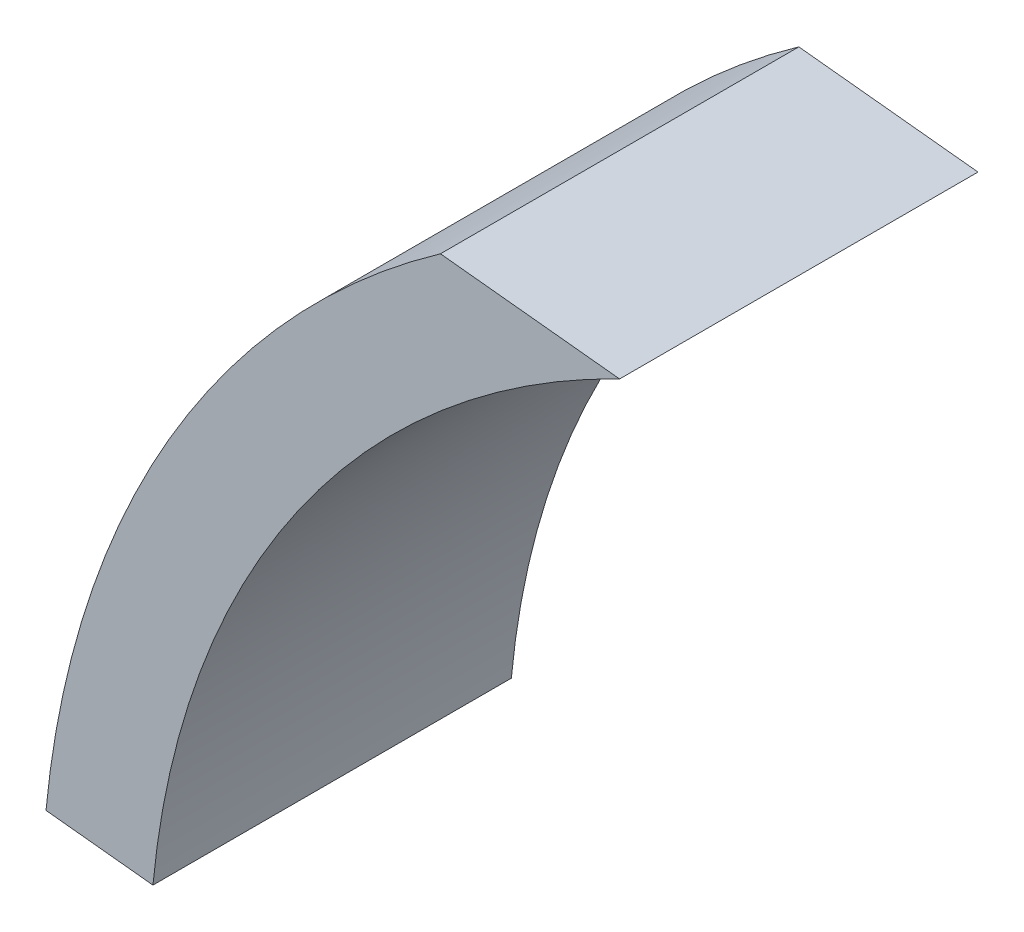
ISO-10303-21;
HEADER;
FILE_DESCRIPTION(('STEP AP214'),'2;1');
FILE_NAME('part.step','',(''),(''),'','','');
FILE_SCHEMA(('AUTOMOTIVE_DESIGN { 1 0 10303 214 1 1 1 1 }'));
ENDSEC;
DATA;
#1=APPLICATION_CONTEXT('core data for automotive mechanical design processes');
#2=APPLICATION_PROTOCOL_DEFINITION('international standard','automotive_design',2000,#1);
#3=PRODUCT_CONTEXT('',#1,'mechanical');
#4=PRODUCT('Part','Part','',(#3));
#5=PRODUCT_RELATED_PRODUCT_CATEGORY('part','',(#4));
#6=PRODUCT_DEFINITION_FORMATION('','',#4);
#7=PRODUCT_DEFINITION_CONTEXT('part definition',#1,'design');
#8=PRODUCT_DEFINITION('design','',#6,#7);
#9=PRODUCT_DEFINITION_SHAPE('','',#8);
#10=(LENGTH_UNIT() NAMED_UNIT(*) SI_UNIT(.MILLI.,.METRE.));
#11=(NAMED_UNIT(*) PLANE_ANGLE_UNIT() SI_UNIT($,.RADIAN.));
#12=(NAMED_UNIT(*) SI_UNIT($,.STERADIAN.) SOLID_ANGLE_UNIT());
#13=UNCERTAINTY_MEASURE_WITH_UNIT(LENGTH_MEASURE(1.E-05),#10,'distance_accuracy_value','');
#14=(GEOMETRIC_REPRESENTATION_CONTEXT(3) GLOBAL_UNCERTAINTY_ASSIGNED_CONTEXT((#13)) GLOBAL_UNIT_ASSIGNED_CONTEXT((#10,
#11,#12)) REPRESENTATION_CONTEXT('',''));
#15=CARTESIAN_POINT('',(0.,0.,0.));
#16=DIRECTION('',(0.,0.,1.));
#17=DIRECTION('',(1.,0.,0.));
#18=AXIS2_PLACEMENT_3D('',#15,#16,#17);
#19=CARTESIAN_POINT('',(0.,0.,6.15));
#20=DIRECTION('',(0.,0.,1.));
#21=DIRECTION('',(1.,0.,0.));
#22=AXIS2_PLACEMENT_3D('',#19,#20,#21);
#23=PLANE('',#22);
#24=DIRECTION('',(0.994521895368273,-0.104528463267654,0.));
#25=VECTOR('',#24,1.);
#26=CARTESIAN_POINT('',(0.826031073261367,7.85916068152122,6.15));
#27=LINE('',#26,#25);
#28=CARTESIAN_POINT('',(-6.04994012159409,8.58185437566532,6.15));
#29=VERTEX_POINT('',#28);
#30=CARTESIAN_POINT('',(-4.05029811740699,8.37168353201012,6.15));
#31=VERTEX_POINT('',#30);
#32=EDGE_CURVE('E46',#29,#31,#27,.T.);
#33=ORIENTED_EDGE('',*,*,#32,.F.);
#34=CARTESIAN_POINT('',(0.,0.,6.15));
#35=DIRECTION('',(0.,0.,1.));
#36=DIRECTION('',(1.,0.,0.));
#37=AXIS2_PLACEMENT_3D('',#34,#35,#36);
#38=CIRCLE('',#37,10.5);
#39=CARTESIAN_POINT('',(-10.452225874404,1.00048701662726,6.15));
#40=VERTEX_POINT('',#39);
#41=EDGE_CURVE('E101',#29,#40,#38,.T.);
#42=ORIENTED_EDGE('',*,*,#41,.T.);
#43=DIRECTION('',(-0.994521895368273,0.104528463267654,0.));
#44=VECTOR('',#43,1.);
#45=CARTESIAN_POINT('',(-0.0101966328798677,-0.0970144814249705,6.15));
#46=LINE('',#45,#44);
#47=CARTESIAN_POINT('',(-9.25874144728863,0.875046748613809,6.15));
#48=VERTEX_POINT('',#47);
#49=EDGE_CURVE('E104',#48,#40,#46,.T.);
#50=ORIENTED_EDGE('',*,*,#49,.F.);
#51=CARTESIAN_POINT('',(0.,0.,6.15));
#52=DIRECTION('',(0.,0.,-1.));
#53=DIRECTION('',(1.,0.,0.));
#54=AXIS2_PLACEMENT_3D('',#51,#52,#53);
#55=CIRCLE('',#54,9.3);
#56=EDGE_CURVE('E84',#48,#31,#55,.T.);
#57=ORIENTED_EDGE('',*,*,#56,.T.);
#58=EDGE_LOOP('',(#33,#42,#50,#57));
#59=FACE_BOUND('',#58,.T.);
#60=ADVANCED_FACE('F38',(#59),#23,.T.);
#61=CARTESIAN_POINT('',(0.,0.,6.15));
#62=DIRECTION('',(0.,0.,-1.));
#63=DIRECTION('',(-1.,0.,0.));
#64=AXIS2_PLACEMENT_3D('',#61,#62,#63);
#65=CYLINDRICAL_SURFACE('',#64,10.5);
#66=ORIENTED_EDGE('',*,*,#41,.F.);
#67=DIRECTION('',(0.,0.,-1.));
#68=VECTOR('',#67,1.);
#69=CARTESIAN_POINT('',(-6.04994012159409,8.58185437566533,6.15));
#70=LINE('',#69,#68);
#71=CARTESIAN_POINT('',(-6.04994012159409,8.58185437566532,2.15));
#72=VERTEX_POINT('',#71);
#73=EDGE_CURVE('E93',#29,#72,#70,.T.);
#74=ORIENTED_EDGE('',*,*,#73,.T.);
#75=CARTESIAN_POINT('',(0.,0.,2.15));
#76=DIRECTION('',(0.,0.,1.));
#77=DIRECTION('',(1.,0.,0.));
#78=AXIS2_PLACEMENT_3D('',#75,#76,#77);
#79=CIRCLE('',#78,10.5);
#80=CARTESIAN_POINT('',(-10.452225874404,1.00048701662726,2.15));
#81=VERTEX_POINT('',#80);
#82=EDGE_CURVE('E11',#72,#81,#79,.T.);
#83=ORIENTED_EDGE('',*,*,#82,.T.);
#84=DIRECTION('',(0.,0.,-1.));
#85=VECTOR('',#84,1.);
#86=CARTESIAN_POINT('',(-10.452225874404,1.00048701662726,6.15));
#87=LINE('',#86,#85);
#88=EDGE_CURVE('E89',#81,#40,#87,.F.);
#89=ORIENTED_EDGE('',*,*,#88,.T.);
#90=EDGE_LOOP('',(#66,#74,#83,#89));
#91=FACE_BOUND('',#90,.T.);
#92=ADVANCED_FACE('F111',(#91),#65,.T.);
#93=CARTESIAN_POINT('',(0.,0.,6.15));
#94=DIRECTION('',(0.,0.,-1.));
#95=DIRECTION('',(-1.,0.,0.));
#96=AXIS2_PLACEMENT_3D('',#93,#94,#95);
#97=CYLINDRICAL_SURFACE('',#96,9.3);
#98=CARTESIAN_POINT('',(0.,0.,2.15));
#99=DIRECTION('',(0.,0.,1.));
#100=DIRECTION('',(1.,0.,0.));
#101=AXIS2_PLACEMENT_3D('',#98,#99,#100);
#102=CIRCLE('',#101,9.3);
#103=CARTESIAN_POINT('',(-9.25874144728863,0.875046748613807,2.15));
#104=VERTEX_POINT('',#103);
#105=CARTESIAN_POINT('',(-4.05029811740699,8.37168353201012,2.15));
#106=VERTEX_POINT('',#105);
#107=EDGE_CURVE('E78',#104,#106,#102,.F.);
#108=ORIENTED_EDGE('',*,*,#107,.T.);
#109=DIRECTION('',(0.,0.,-1.));
#110=VECTOR('',#109,1.);
#111=CARTESIAN_POINT('',(-4.05029811740699,8.37168353201012,6.15));
#112=LINE('',#111,#110);
#113=EDGE_CURVE('E85',#106,#31,#112,.F.);
#114=ORIENTED_EDGE('',*,*,#113,.T.);
#115=ORIENTED_EDGE('',*,*,#56,.F.);
#116=DIRECTION('',(0.,0.,-1.));
#117=VECTOR('',#116,1.);
#118=CARTESIAN_POINT('',(-9.25874144728863,0.875046748613809,6.15));
#119=LINE('',#118,#117);
#120=EDGE_CURVE('E53',#48,#104,#119,.T.);
#121=ORIENTED_EDGE('',*,*,#120,.T.);
#122=EDGE_LOOP('',(#108,#114,#115,#121));
#123=FACE_BOUND('',#122,.T.);
#124=ADVANCED_FACE('F40',(#123),#97,.F.);
#125=CARTESIAN_POINT('',(11.1544143545613,6.77360385520938,6.15));
#126=DIRECTION('',(-0.104528463267654,-0.994521895368273,0.));
#127=DIRECTION('',(0.994521895368273,-0.104528463267654,0.));
#128=AXIS2_PLACEMENT_3D('',#125,#126,#127);
#129=PLANE('',#128);
#130=DIRECTION('',(-0.994521895368273,0.104528463267654,0.));
#131=VECTOR('',#130,1.);
#132=CARTESIAN_POINT('',(11.1544143545613,6.77360385520938,2.15));
#133=LINE('',#132,#131);
#134=EDGE_CURVE('E81',#106,#72,#133,.T.);
#135=ORIENTED_EDGE('',*,*,#134,.T.);
#136=ORIENTED_EDGE('',*,*,#73,.F.);
#137=ORIENTED_EDGE('',*,*,#32,.T.);
#138=ORIENTED_EDGE('',*,*,#113,.F.);
#139=EDGE_LOOP('',(#135,#136,#137,#138));
#140=FACE_BOUND('',#139,.T.);
#141=ADVANCED_FACE('F107',(#140),#129,.F.);
#142=CARTESIAN_POINT('',(10.3181866484201,-1.18257130773681,6.15));
#143=DIRECTION('',(0.104528463267654,0.994521895368273,0.));
#144=DIRECTION('',(-0.994521895368273,0.104528463267654,0.));
#145=AXIS2_PLACEMENT_3D('',#142,#143,#144);
#146=PLANE('',#145);
#147=ORIENTED_EDGE('',*,*,#49,.T.);
#148=ORIENTED_EDGE('',*,*,#88,.F.);
#149=DIRECTION('',(-0.994521895368273,0.104528463267654,0.));
#150=VECTOR('',#149,1.);
#151=CARTESIAN_POINT('',(10.3181866484201,-1.18257130773681,2.15));
#152=LINE('',#151,#150);
#153=EDGE_CURVE('E80',#104,#81,#152,.T.);
#154=ORIENTED_EDGE('',*,*,#153,.F.);
#155=ORIENTED_EDGE('',*,*,#120,.F.);
#156=EDGE_LOOP('',(#147,#148,#154,#155));
#157=FACE_BOUND('',#156,.T.);
#158=ADVANCED_FACE('F87',(#157),#146,.F.);
#159=CARTESIAN_POINT('',(10.3181866484201,-1.18257130773681,2.15));
#160=DIRECTION('',(0.,0.,1.));
#161=DIRECTION('',(1.,0.,0.));
#162=AXIS2_PLACEMENT_3D('',#159,#160,#161);
#163=PLANE('',#162);
#164=ORIENTED_EDGE('',*,*,#153,.T.);
#165=ORIENTED_EDGE('',*,*,#82,.F.);
#166=ORIENTED_EDGE('',*,*,#134,.F.);
#167=ORIENTED_EDGE('',*,*,#107,.F.);
#168=EDGE_LOOP('',(#164,#165,#166,#167));
#169=FACE_BOUND('',#168,.T.);
#170=ADVANCED_FACE('F79',(#169),#163,.F.);
#171=CLOSED_SHELL('',(#60,#92,#124,#141,#158,#170));
#172=MANIFOLD_SOLID_BREP('B2',#171);
#173=ADVANCED_BREP_SHAPE_REPRESENTATION('',(#18,#172),#14);
#174=SHAPE_DEFINITION_REPRESENTATION(#9,#173);
ENDSEC;
END-ISO-10303-21;
